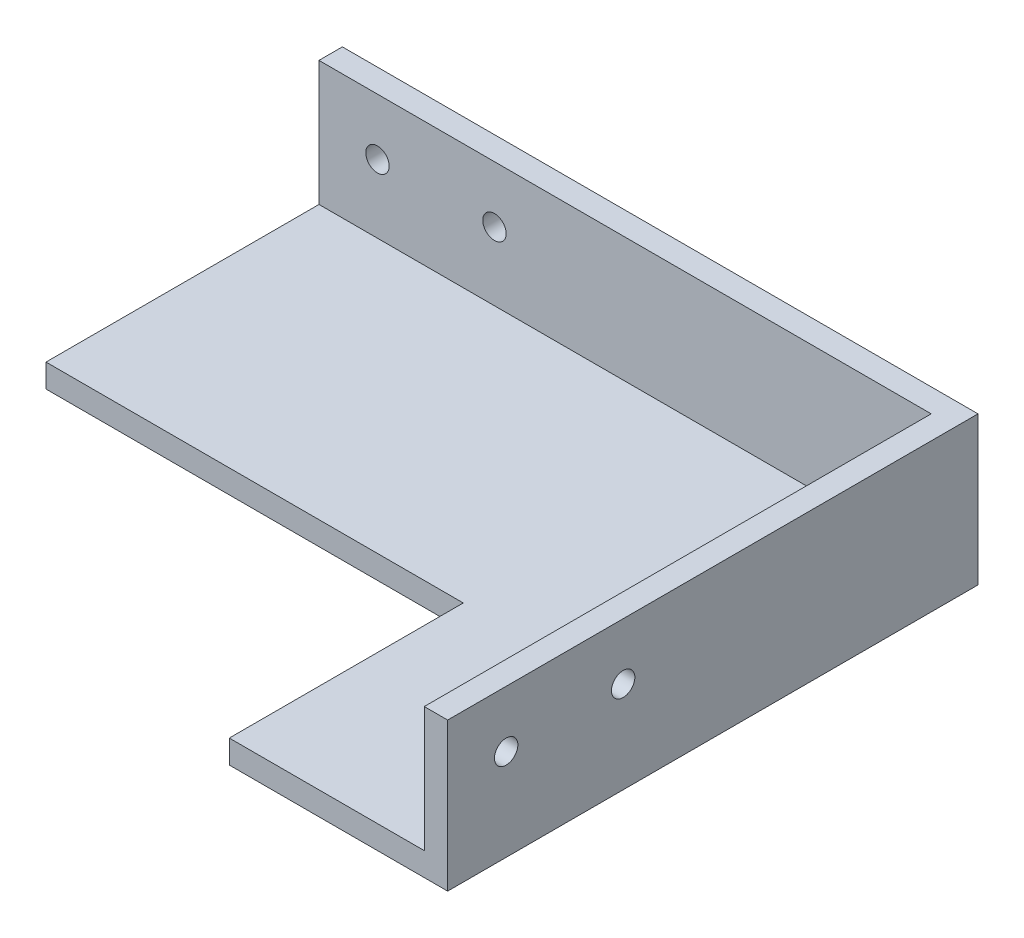
ISO-10303-21;
HEADER;
FILE_DESCRIPTION(('STEP AP214'),'2;1');
FILE_NAME('part.step','',(''),(''),'','','');
FILE_SCHEMA(('AUTOMOTIVE_DESIGN { 1 0 10303 214 1 1 1 1 }'));
ENDSEC;
DATA;
#1=APPLICATION_CONTEXT('core data for automotive mechanical design processes');
#2=APPLICATION_PROTOCOL_DEFINITION('international standard','automotive_design',2000,#1);
#3=PRODUCT_CONTEXT('',#1,'mechanical');
#4=PRODUCT('Part','Part','',(#3));
#5=PRODUCT_RELATED_PRODUCT_CATEGORY('part','',(#4));
#6=PRODUCT_DEFINITION_FORMATION('','',#4);
#7=PRODUCT_DEFINITION_CONTEXT('part definition',#1,'design');
#8=PRODUCT_DEFINITION('design','',#6,#7);
#9=PRODUCT_DEFINITION_SHAPE('','',#8);
#10=(LENGTH_UNIT() NAMED_UNIT(*) SI_UNIT(.MILLI.,.METRE.));
#11=(NAMED_UNIT(*) PLANE_ANGLE_UNIT() SI_UNIT($,.RADIAN.));
#12=(NAMED_UNIT(*) SI_UNIT($,.STERADIAN.) SOLID_ANGLE_UNIT());
#13=UNCERTAINTY_MEASURE_WITH_UNIT(LENGTH_MEASURE(1.E-05),#10,'distance_accuracy_value','');
#14=(GEOMETRIC_REPRESENTATION_CONTEXT(3) GLOBAL_UNCERTAINTY_ASSIGNED_CONTEXT((#13)) GLOBAL_UNIT_ASSIGNED_CONTEXT((#10,
#11,#12)) REPRESENTATION_CONTEXT('',''));
#15=CARTESIAN_POINT('',(0.,0.,0.));
#16=DIRECTION('',(0.,0.,1.));
#17=DIRECTION('',(1.,0.,0.));
#18=AXIS2_PLACEMENT_3D('',#15,#16,#17);
#19=CARTESIAN_POINT('',(-39.25,3.,-32.5));
#20=DIRECTION('',(1.,0.,0.));
#21=DIRECTION('',(0.,0.,-1.));
#22=AXIS2_PLACEMENT_3D('',#19,#20,#21);
#23=PLANE('',#22);
#24=DIRECTION('',(0.,0.,1.));
#25=VECTOR('',#24,1.);
#26=CARTESIAN_POINT('',(-39.25,0.,-32.5));
#27=LINE('',#26,#25);
#28=CARTESIAN_POINT('',(-39.25,0.,-35.5));
#29=VERTEX_POINT('',#28);
#30=CARTESIAN_POINT('',(-39.25,0.,2.5));
#31=VERTEX_POINT('',#30);
#32=EDGE_CURVE('E108',#29,#31,#27,.T.);
#33=ORIENTED_EDGE('',*,*,#32,.T.);
#34=DIRECTION('',(0.,-1.,0.));
#35=VECTOR('',#34,1.);
#36=CARTESIAN_POINT('',(-39.25,3.,2.5));
#37=LINE('',#36,#35);
#38=CARTESIAN_POINT('',(-39.25,3.,2.5));
#39=VERTEX_POINT('',#38);
#40=EDGE_CURVE('E11',#39,#31,#37,.T.);
#41=ORIENTED_EDGE('',*,*,#40,.F.);
#42=DIRECTION('',(0.,0.,1.));
#43=VECTOR('',#42,1.);
#44=CARTESIAN_POINT('',(-39.25,3.,-32.5));
#45=LINE('',#44,#43);
#46=CARTESIAN_POINT('',(-39.25,3.,-32.5));
#47=VERTEX_POINT('',#46);
#48=EDGE_CURVE('E81',#47,#39,#45,.T.);
#49=ORIENTED_EDGE('',*,*,#48,.F.);
#50=DIRECTION('',(0.,1.,0.));
#51=VECTOR('',#50,1.);
#52=CARTESIAN_POINT('',(-39.25,0.,-32.5));
#53=LINE('',#52,#51);
#54=CARTESIAN_POINT('',(-39.25,19.,-32.5));
#55=VERTEX_POINT('',#54);
#56=EDGE_CURVE('E129',#47,#55,#53,.T.);
#57=ORIENTED_EDGE('',*,*,#56,.T.);
#58=DIRECTION('',(0.,0.,1.));
#59=VECTOR('',#58,1.);
#60=CARTESIAN_POINT('',(-39.25,19.,-35.5));
#61=LINE('',#60,#59);
#62=CARTESIAN_POINT('',(-39.25,19.,-35.5));
#63=VERTEX_POINT('',#62);
#64=EDGE_CURVE('E156',#63,#55,#61,.T.);
#65=ORIENTED_EDGE('',*,*,#64,.F.);
#66=DIRECTION('',(0.,1.,0.));
#67=VECTOR('',#66,1.);
#68=CARTESIAN_POINT('',(-39.25,0.,-35.5));
#69=LINE('',#68,#67);
#70=EDGE_CURVE('E144',#29,#63,#69,.T.);
#71=ORIENTED_EDGE('',*,*,#70,.F.);
#72=EDGE_LOOP('',(#33,#41,#49,#57,#65,#71));
#73=FACE_BOUND('',#72,.T.);
#74=ADVANCED_FACE('F32',(#73),#23,.F.);
#75=CARTESIAN_POINT('',(-39.25,3.,2.5));
#76=DIRECTION('',(0.,0.,-1.));
#77=DIRECTION('',(-1.,0.,0.));
#78=AXIS2_PLACEMENT_3D('',#75,#76,#77);
#79=PLANE('',#78);
#80=DIRECTION('',(1.,0.,0.));
#81=VECTOR('',#80,1.);
#82=CARTESIAN_POINT('',(-39.25,0.,2.5));
#83=LINE('',#82,#81);
#84=CARTESIAN_POINT('',(14.25,0.,2.5));
#85=VERTEX_POINT('',#84);
#86=EDGE_CURVE('E65',#31,#85,#83,.T.);
#87=ORIENTED_EDGE('',*,*,#86,.T.);
#88=DIRECTION('',(0.,-1.,0.));
#89=VECTOR('',#88,1.);
#90=CARTESIAN_POINT('',(14.25,3.,2.5));
#91=LINE('',#90,#89);
#92=CARTESIAN_POINT('',(14.25,3.,2.5));
#93=VERTEX_POINT('',#92);
#94=EDGE_CURVE('E41',#93,#85,#91,.T.);
#95=ORIENTED_EDGE('',*,*,#94,.F.);
#96=DIRECTION('',(1.,0.,0.));
#97=VECTOR('',#96,1.);
#98=CARTESIAN_POINT('',(-39.25,3.,2.5));
#99=LINE('',#98,#97);
#100=EDGE_CURVE('E89',#39,#93,#99,.T.);
#101=ORIENTED_EDGE('',*,*,#100,.F.);
#102=ORIENTED_EDGE('',*,*,#40,.T.);
#103=EDGE_LOOP('',(#87,#95,#101,#102));
#104=FACE_BOUND('',#103,.T.);
#105=ADVANCED_FACE('F95',(#104),#79,.F.);
#106=CARTESIAN_POINT('',(14.25,3.,2.5));
#107=DIRECTION('',(1.,0.,0.));
#108=DIRECTION('',(0.,0.,-1.));
#109=AXIS2_PLACEMENT_3D('',#106,#107,#108);
#110=PLANE('',#109);
#111=DIRECTION('',(0.,0.,1.));
#112=VECTOR('',#111,1.);
#113=CARTESIAN_POINT('',(14.25,0.,2.5));
#114=LINE('',#113,#112);
#115=CARTESIAN_POINT('',(14.25,0.,32.5));
#116=VERTEX_POINT('',#115);
#117=EDGE_CURVE('E72',#85,#116,#114,.T.);
#118=ORIENTED_EDGE('',*,*,#117,.T.);
#119=DIRECTION('',(0.,-1.,0.));
#120=VECTOR('',#119,1.);
#121=CARTESIAN_POINT('',(14.25,3.,32.5));
#122=LINE('',#121,#120);
#123=CARTESIAN_POINT('',(14.25,3.,32.5));
#124=VERTEX_POINT('',#123);
#125=EDGE_CURVE('E96',#124,#116,#122,.T.);
#126=ORIENTED_EDGE('',*,*,#125,.F.);
#127=DIRECTION('',(0.,0.,1.));
#128=VECTOR('',#127,1.);
#129=CARTESIAN_POINT('',(14.25,3.,2.5));
#130=LINE('',#129,#128);
#131=EDGE_CURVE('E93',#93,#124,#130,.T.);
#132=ORIENTED_EDGE('',*,*,#131,.F.);
#133=ORIENTED_EDGE('',*,*,#94,.T.);
#134=EDGE_LOOP('',(#118,#126,#132,#133));
#135=FACE_BOUND('',#134,.T.);
#136=ADVANCED_FACE('F98',(#135),#110,.F.);
#137=CARTESIAN_POINT('',(14.25,3.,32.5));
#138=DIRECTION('',(0.,0.,-1.));
#139=DIRECTION('',(-1.,0.,0.));
#140=AXIS2_PLACEMENT_3D('',#137,#138,#139);
#141=PLANE('',#140);
#142=DIRECTION('',(1.,0.,0.));
#143=VECTOR('',#142,1.);
#144=CARTESIAN_POINT('',(14.25,0.,32.5));
#145=LINE('',#144,#143);
#146=CARTESIAN_POINT('',(42.25,0.,32.5));
#147=VERTEX_POINT('',#146);
#148=EDGE_CURVE('E114',#116,#147,#145,.T.);
#149=ORIENTED_EDGE('',*,*,#148,.T.);
#150=DIRECTION('',(0.,-1.,0.));
#151=VECTOR('',#150,1.);
#152=CARTESIAN_POINT('',(42.25,0.,32.5));
#153=LINE('',#152,#151);
#154=CARTESIAN_POINT('',(42.25,19.,32.5));
#155=VERTEX_POINT('',#154);
#156=EDGE_CURVE('E122',#155,#147,#153,.T.);
#157=ORIENTED_EDGE('',*,*,#156,.F.);
#158=DIRECTION('',(-1.,0.,0.));
#159=VECTOR('',#158,1.);
#160=CARTESIAN_POINT('',(42.25,19.,32.5));
#161=LINE('',#160,#159);
#162=CARTESIAN_POINT('',(39.25,19.,32.5));
#163=VERTEX_POINT('',#162);
#164=EDGE_CURVE('E172',#155,#163,#161,.T.);
#165=ORIENTED_EDGE('',*,*,#164,.T.);
#166=DIRECTION('',(0.,-1.,0.));
#167=VECTOR('',#166,1.);
#168=CARTESIAN_POINT('',(39.25,0.,32.5));
#169=LINE('',#168,#167);
#170=CARTESIAN_POINT('',(39.25,3.,32.5));
#171=VERTEX_POINT('',#170);
#172=EDGE_CURVE('E178',#163,#171,#169,.T.);
#173=ORIENTED_EDGE('',*,*,#172,.T.);
#174=DIRECTION('',(1.,0.,0.));
#175=VECTOR('',#174,1.);
#176=CARTESIAN_POINT('',(14.25,3.,32.5));
#177=LINE('',#176,#175);
#178=EDGE_CURVE('E100',#124,#171,#177,.T.);
#179=ORIENTED_EDGE('',*,*,#178,.F.);
#180=ORIENTED_EDGE('',*,*,#125,.T.);
#181=EDGE_LOOP('',(#149,#157,#165,#173,#179,#180));
#182=FACE_BOUND('',#181,.T.);
#183=ADVANCED_FACE('F218',(#182),#141,.F.);
#184=CARTESIAN_POINT('',(0.,3.,0.));
#185=DIRECTION('',(0.,1.,0.));
#186=DIRECTION('',(0.,0.,1.));
#187=AXIS2_PLACEMENT_3D('',#184,#185,#186);
#188=PLANE('',#187);
#189=DIRECTION('',(-1.,0.,0.));
#190=VECTOR('',#189,1.);
#191=CARTESIAN_POINT('',(39.25,3.,-32.5));
#192=LINE('',#191,#190);
#193=CARTESIAN_POINT('',(39.25,3.,-32.5));
#194=VERTEX_POINT('',#193);
#195=EDGE_CURVE('E112',#194,#47,#192,.T.);
#196=ORIENTED_EDGE('',*,*,#195,.T.);
#197=ORIENTED_EDGE('',*,*,#48,.T.);
#198=ORIENTED_EDGE('',*,*,#100,.T.);
#199=ORIENTED_EDGE('',*,*,#131,.T.);
#200=ORIENTED_EDGE('',*,*,#178,.T.);
#201=DIRECTION('',(0.,0.,-1.));
#202=VECTOR('',#201,1.);
#203=CARTESIAN_POINT('',(39.25,3.,32.5));
#204=LINE('',#203,#202);
#205=EDGE_CURVE('E102',#171,#194,#204,.T.);
#206=ORIENTED_EDGE('',*,*,#205,.T.);
#207=EDGE_LOOP('',(#196,#197,#198,#199,#200,#206));
#208=FACE_BOUND('',#207,.T.);
#209=ADVANCED_FACE('F90',(#208),#188,.T.);
#210=CARTESIAN_POINT('',(0.,0.,0.));
#211=DIRECTION('',(0.,1.,0.));
#212=DIRECTION('',(0.,0.,1.));
#213=AXIS2_PLACEMENT_3D('',#210,#211,#212);
#214=PLANE('',#213);
#215=ORIENTED_EDGE('',*,*,#32,.F.);
#216=DIRECTION('',(-1.,0.,0.));
#217=VECTOR('',#216,1.);
#218=CARTESIAN_POINT('',(-39.25,0.,-35.5));
#219=LINE('',#218,#217);
#220=CARTESIAN_POINT('',(42.25,0.,-35.5));
#221=VERTEX_POINT('',#220);
#222=EDGE_CURVE('E153',#221,#29,#219,.T.);
#223=ORIENTED_EDGE('',*,*,#222,.F.);
#224=DIRECTION('',(0.,0.,-1.));
#225=VECTOR('',#224,1.);
#226=CARTESIAN_POINT('',(42.25,0.,32.5));
#227=LINE('',#226,#225);
#228=EDGE_CURVE('E166',#147,#221,#227,.T.);
#229=ORIENTED_EDGE('',*,*,#228,.F.);
#230=ORIENTED_EDGE('',*,*,#148,.F.);
#231=ORIENTED_EDGE('',*,*,#117,.F.);
#232=ORIENTED_EDGE('',*,*,#86,.F.);
#233=EDGE_LOOP('',(#215,#223,#229,#230,#231,#232));
#234=FACE_BOUND('',#233,.T.);
#235=ADVANCED_FACE('F226',(#234),#214,.F.);
#236=CARTESIAN_POINT('',(39.25,0.,0.));
#237=DIRECTION('',(-1.,0.,0.));
#238=DIRECTION('',(0.,0.,1.));
#239=AXIS2_PLACEMENT_3D('',#236,#237,#238);
#240=PLANE('',#239);
#241=CARTESIAN_POINT('',(39.25,11.75,10.));
#242=DIRECTION('',(-1.,0.,0.));
#243=DIRECTION('',(0.,0.,1.));
#244=AXIS2_PLACEMENT_3D('',#241,#242,#243);
#245=CIRCLE('',#244,1.5);
#246=CARTESIAN_POINT('',(39.25,11.75,11.5));
#247=VERTEX_POINT('',#246);
#248=EDGE_CURVE('E265',#247,#247,#245,.T.);
#249=ORIENTED_EDGE('',*,*,#248,.F.);
#250=EDGE_LOOP('',(#249));
#251=FACE_BOUND('',#250,.T.);
#252=CARTESIAN_POINT('',(39.25,11.75,25.));
#253=DIRECTION('',(-1.,0.,0.));
#254=DIRECTION('',(0.,0.,1.));
#255=AXIS2_PLACEMENT_3D('',#252,#253,#254);
#256=CIRCLE('',#255,1.5);
#257=CARTESIAN_POINT('',(39.25,11.75,26.5));
#258=VERTEX_POINT('',#257);
#259=EDGE_CURVE('E268',#258,#258,#256,.T.);
#260=ORIENTED_EDGE('',*,*,#259,.F.);
#261=EDGE_LOOP('',(#260));
#262=FACE_BOUND('',#261,.T.);
#263=ORIENTED_EDGE('',*,*,#205,.F.);
#264=ORIENTED_EDGE('',*,*,#172,.F.);
#265=DIRECTION('',(0.,0.,1.));
#266=VECTOR('',#265,1.);
#267=CARTESIAN_POINT('',(39.25,19.,32.5));
#268=LINE('',#267,#266);
#269=CARTESIAN_POINT('',(39.25,19.,-32.5));
#270=VERTEX_POINT('',#269);
#271=EDGE_CURVE('E119',#270,#163,#268,.T.);
#272=ORIENTED_EDGE('',*,*,#271,.F.);
#273=DIRECTION('',(0.,1.,0.));
#274=VECTOR('',#273,1.);
#275=CARTESIAN_POINT('',(39.25,0.,-32.5));
#276=LINE('',#275,#274);
#277=EDGE_CURVE('E50',#194,#270,#276,.T.);
#278=ORIENTED_EDGE('',*,*,#277,.F.);
#279=EDGE_LOOP('',(#263,#264,#272,#278));
#280=FACE_BOUND('',#279,.T.);
#281=ADVANCED_FACE('F216',(#251,#262,#280),#240,.T.);
#282=CARTESIAN_POINT('',(42.25,19.,32.5));
#283=DIRECTION('',(0.,-1.,0.));
#284=DIRECTION('',(0.,0.,-1.));
#285=AXIS2_PLACEMENT_3D('',#282,#283,#284);
#286=PLANE('',#285);
#287=ORIENTED_EDGE('',*,*,#271,.T.);
#288=ORIENTED_EDGE('',*,*,#164,.F.);
#289=DIRECTION('',(0.,0.,1.));
#290=VECTOR('',#289,1.);
#291=CARTESIAN_POINT('',(42.25,19.,32.5));
#292=LINE('',#291,#290);
#293=CARTESIAN_POINT('',(42.25,19.,-35.5));
#294=VERTEX_POINT('',#293);
#295=EDGE_CURVE('E169',#294,#155,#292,.T.);
#296=ORIENTED_EDGE('',*,*,#295,.F.);
#297=DIRECTION('',(1.,0.,0.));
#298=VECTOR('',#297,1.);
#299=CARTESIAN_POINT('',(-39.25,19.,-35.5));
#300=LINE('',#299,#298);
#301=EDGE_CURVE('E147',#63,#294,#300,.T.);
#302=ORIENTED_EDGE('',*,*,#301,.F.);
#303=ORIENTED_EDGE('',*,*,#64,.T.);
#304=DIRECTION('',(1.,0.,0.));
#305=VECTOR('',#304,1.);
#306=CARTESIAN_POINT('',(-39.25,19.,-32.5));
#307=LINE('',#306,#305);
#308=EDGE_CURVE('E133',#55,#270,#307,.T.);
#309=ORIENTED_EDGE('',*,*,#308,.T.);
#310=EDGE_LOOP('',(#287,#288,#296,#302,#303,#309));
#311=FACE_BOUND('',#310,.T.);
#312=ADVANCED_FACE('F192',(#311),#286,.F.);
#313=CARTESIAN_POINT('',(42.25,0.,0.));
#314=DIRECTION('',(-1.,0.,0.));
#315=DIRECTION('',(0.,0.,1.));
#316=AXIS2_PLACEMENT_3D('',#313,#314,#315);
#317=PLANE('',#316);
#318=CARTESIAN_POINT('',(42.25,11.75,10.));
#319=DIRECTION('',(1.,0.,0.));
#320=DIRECTION('',(0.,0.,-1.));
#321=AXIS2_PLACEMENT_3D('',#318,#319,#320);
#322=CIRCLE('',#321,1.5);
#323=CARTESIAN_POINT('',(42.25,11.75,8.5));
#324=VERTEX_POINT('',#323);
#325=EDGE_CURVE('E276',#324,#324,#322,.T.);
#326=ORIENTED_EDGE('',*,*,#325,.F.);
#327=EDGE_LOOP('',(#326));
#328=FACE_BOUND('',#327,.T.);
#329=CARTESIAN_POINT('',(42.25,11.75,25.));
#330=DIRECTION('',(1.,0.,0.));
#331=DIRECTION('',(0.,0.,-1.));
#332=AXIS2_PLACEMENT_3D('',#329,#330,#331);
#333=CIRCLE('',#332,1.5);
#334=CARTESIAN_POINT('',(42.25,11.75,23.5));
#335=VERTEX_POINT('',#334);
#336=EDGE_CURVE('E270',#335,#335,#333,.T.);
#337=ORIENTED_EDGE('',*,*,#336,.F.);
#338=EDGE_LOOP('',(#337));
#339=FACE_BOUND('',#338,.T.);
#340=ORIENTED_EDGE('',*,*,#156,.T.);
#341=ORIENTED_EDGE('',*,*,#228,.T.);
#342=DIRECTION('',(0.,-1.,0.));
#343=VECTOR('',#342,1.);
#344=CARTESIAN_POINT('',(42.25,0.,-35.5));
#345=LINE('',#344,#343);
#346=EDGE_CURVE('E150',#294,#221,#345,.T.);
#347=ORIENTED_EDGE('',*,*,#346,.F.);
#348=ORIENTED_EDGE('',*,*,#295,.T.);
#349=EDGE_LOOP('',(#340,#341,#347,#348));
#350=FACE_BOUND('',#349,.T.);
#351=ADVANCED_FACE('F228',(#328,#339,#350),#317,.F.);
#352=CARTESIAN_POINT('',(0.,0.,-35.5));
#353=DIRECTION('',(0.,0.,-1.));
#354=DIRECTION('',(-1.,0.,0.));
#355=AXIS2_PLACEMENT_3D('',#352,#353,#354);
#356=PLANE('',#355);
#357=CARTESIAN_POINT('',(-16.75,11.75,-35.5));
#358=DIRECTION('',(0.,0.,-1.));
#359=DIRECTION('',(-1.,0.,0.));
#360=AXIS2_PLACEMENT_3D('',#357,#358,#359);
#361=CIRCLE('',#360,1.5);
#362=CARTESIAN_POINT('',(-18.25,11.75,-35.5));
#363=VERTEX_POINT('',#362);
#364=EDGE_CURVE('E140',#363,#363,#361,.T.);
#365=ORIENTED_EDGE('',*,*,#364,.F.);
#366=EDGE_LOOP('',(#365));
#367=FACE_BOUND('',#366,.T.);
#368=CARTESIAN_POINT('',(-31.75,11.75,-35.5));
#369=DIRECTION('',(0.,0.,-1.));
#370=DIRECTION('',(-1.,0.,0.));
#371=AXIS2_PLACEMENT_3D('',#368,#369,#370);
#372=CIRCLE('',#371,1.5);
#373=CARTESIAN_POINT('',(-33.25,11.75,-35.5));
#374=VERTEX_POINT('',#373);
#375=EDGE_CURVE('E130',#374,#374,#372,.T.);
#376=ORIENTED_EDGE('',*,*,#375,.F.);
#377=EDGE_LOOP('',(#376));
#378=FACE_BOUND('',#377,.T.);
#379=ORIENTED_EDGE('',*,*,#70,.T.);
#380=ORIENTED_EDGE('',*,*,#301,.T.);
#381=ORIENTED_EDGE('',*,*,#346,.T.);
#382=ORIENTED_EDGE('',*,*,#222,.T.);
#383=EDGE_LOOP('',(#379,#380,#381,#382));
#384=FACE_BOUND('',#383,.T.);
#385=ADVANCED_FACE('F230',(#367,#378,#384),#356,.T.);
#386=CARTESIAN_POINT('',(0.,0.,-32.5));
#387=DIRECTION('',(0.,0.,-1.));
#388=DIRECTION('',(-1.,0.,0.));
#389=AXIS2_PLACEMENT_3D('',#386,#387,#388);
#390=PLANE('',#389);
#391=CARTESIAN_POINT('',(-16.75,11.75,-32.5));
#392=DIRECTION('',(0.,0.,-1.));
#393=DIRECTION('',(-1.,0.,0.));
#394=AXIS2_PLACEMENT_3D('',#391,#392,#393);
#395=CIRCLE('',#394,1.5);
#396=CARTESIAN_POINT('',(-18.25,11.75,-32.5));
#397=VERTEX_POINT('',#396);
#398=EDGE_CURVE('E35',#397,#397,#395,.T.);
#399=ORIENTED_EDGE('',*,*,#398,.T.);
#400=EDGE_LOOP('',(#399));
#401=FACE_BOUND('',#400,.T.);
#402=CARTESIAN_POINT('',(-31.75,11.75,-32.5));
#403=DIRECTION('',(0.,0.,-1.));
#404=DIRECTION('',(-1.,0.,0.));
#405=AXIS2_PLACEMENT_3D('',#402,#403,#404);
#406=CIRCLE('',#405,1.5);
#407=CARTESIAN_POINT('',(-33.25,11.75,-32.5));
#408=VERTEX_POINT('',#407);
#409=EDGE_CURVE('E127',#408,#408,#406,.T.);
#410=ORIENTED_EDGE('',*,*,#409,.T.);
#411=EDGE_LOOP('',(#410));
#412=FACE_BOUND('',#411,.T.);
#413=ORIENTED_EDGE('',*,*,#195,.F.);
#414=ORIENTED_EDGE('',*,*,#277,.T.);
#415=ORIENTED_EDGE('',*,*,#308,.F.);
#416=ORIENTED_EDGE('',*,*,#56,.F.);
#417=EDGE_LOOP('',(#413,#414,#415,#416));
#418=FACE_BOUND('',#417,.T.);
#419=ADVANCED_FACE('F184',(#401,#412,#418),#390,.F.);
#420=CARTESIAN_POINT('',(-31.75,11.75,32.50005));
#421=DIRECTION('',(0.,0.,-1.));
#422=DIRECTION('',(-1.,0.,0.));
#423=AXIS2_PLACEMENT_3D('',#420,#421,#422);
#424=CYLINDRICAL_SURFACE('',#423,1.5);
#425=ORIENTED_EDGE('',*,*,#375,.T.);
#426=EDGE_LOOP('',(#425));
#427=FACE_BOUND('',#426,.T.);
#428=ORIENTED_EDGE('',*,*,#409,.F.);
#429=EDGE_LOOP('',(#428));
#430=FACE_BOUND('',#429,.T.);
#431=ADVANCED_FACE('F292',(#427,#430),#424,.F.);
#432=CARTESIAN_POINT('',(-16.75,11.75,32.50005));
#433=DIRECTION('',(0.,0.,-1.));
#434=DIRECTION('',(-1.,0.,0.));
#435=AXIS2_PLACEMENT_3D('',#432,#433,#434);
#436=CYLINDRICAL_SURFACE('',#435,1.5);
#437=ORIENTED_EDGE('',*,*,#364,.T.);
#438=EDGE_LOOP('',(#437));
#439=FACE_BOUND('',#438,.T.);
#440=ORIENTED_EDGE('',*,*,#398,.F.);
#441=EDGE_LOOP('',(#440));
#442=FACE_BOUND('',#441,.T.);
#443=ADVANCED_FACE('F287',(#439,#442),#436,.F.);
#444=CARTESIAN_POINT('',(-39.25005,11.75,25.));
#445=DIRECTION('',(1.,0.,0.));
#446=DIRECTION('',(0.,0.,-1.));
#447=AXIS2_PLACEMENT_3D('',#444,#445,#446);
#448=CYLINDRICAL_SURFACE('',#447,1.5);
#449=ORIENTED_EDGE('',*,*,#259,.T.);
#450=EDGE_LOOP('',(#449));
#451=FACE_BOUND('',#450,.T.);
#452=ORIENTED_EDGE('',*,*,#336,.T.);
#453=EDGE_LOOP('',(#452));
#454=FACE_BOUND('',#453,.T.);
#455=ADVANCED_FACE('F281',(#451,#454),#448,.F.);
#456=CARTESIAN_POINT('',(-39.25005,11.75,10.));
#457=DIRECTION('',(1.,0.,0.));
#458=DIRECTION('',(0.,0.,-1.));
#459=AXIS2_PLACEMENT_3D('',#456,#457,#458);
#460=CYLINDRICAL_SURFACE('',#459,1.5);
#461=ORIENTED_EDGE('',*,*,#248,.T.);
#462=EDGE_LOOP('',(#461));
#463=FACE_BOUND('',#462,.T.);
#464=ORIENTED_EDGE('',*,*,#325,.T.);
#465=EDGE_LOOP('',(#464));
#466=FACE_BOUND('',#465,.T.);
#467=ADVANCED_FACE('F279',(#463,#466),#460,.F.);
#468=CLOSED_SHELL('',(#74,#105,#136,#183,#209,#235,#281,#312,#351,#385,#419,#431,#443,#455,#467));
#469=MANIFOLD_SOLID_BREP('B2',#468);
#470=ADVANCED_BREP_SHAPE_REPRESENTATION('',(#18,#469),#14);
#471=SHAPE_DEFINITION_REPRESENTATION(#9,#470);
ENDSEC;
END-ISO-10303-21;
